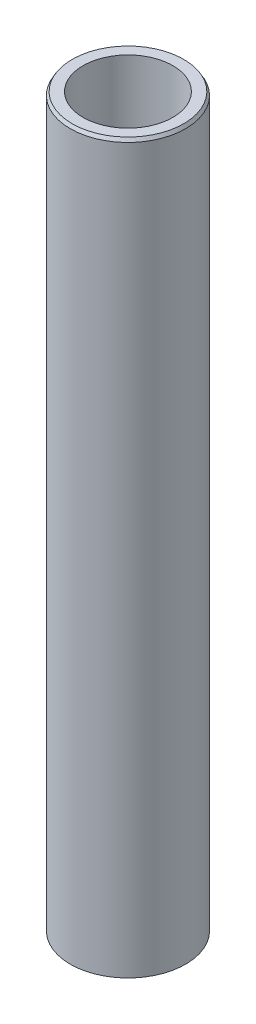
ISO-10303-21;
HEADER;
FILE_DESCRIPTION(('STEP AP214'),'2;1');
FILE_NAME('part.step','',(''),(''),'','','');
FILE_SCHEMA(('AUTOMOTIVE_DESIGN { 1 0 10303 214 1 1 1 1 }'));
ENDSEC;
DATA;
#1=APPLICATION_CONTEXT('core data for automotive mechanical design processes');
#2=APPLICATION_PROTOCOL_DEFINITION('international standard','automotive_design',2000,#1);
#3=PRODUCT_CONTEXT('',#1,'mechanical');
#4=PRODUCT('Part','Part','',(#3));
#5=PRODUCT_RELATED_PRODUCT_CATEGORY('part','',(#4));
#6=PRODUCT_DEFINITION_FORMATION('','',#4);
#7=PRODUCT_DEFINITION_CONTEXT('part definition',#1,'design');
#8=PRODUCT_DEFINITION('design','',#6,#7);
#9=PRODUCT_DEFINITION_SHAPE('','',#8);
#10=(LENGTH_UNIT() NAMED_UNIT(*) SI_UNIT(.MILLI.,.METRE.));
#11=(NAMED_UNIT(*) PLANE_ANGLE_UNIT() SI_UNIT($,.RADIAN.));
#12=(NAMED_UNIT(*) SI_UNIT($,.STERADIAN.) SOLID_ANGLE_UNIT());
#13=UNCERTAINTY_MEASURE_WITH_UNIT(LENGTH_MEASURE(1.E-05),#10,'distance_accuracy_value','');
#14=(GEOMETRIC_REPRESENTATION_CONTEXT(3) GLOBAL_UNCERTAINTY_ASSIGNED_CONTEXT((#13)) GLOBAL_UNIT_ASSIGNED_CONTEXT((#10,
#11,#12)) REPRESENTATION_CONTEXT('',''));
#15=CARTESIAN_POINT('',(0.,0.,0.));
#16=DIRECTION('',(0.,0.,1.));
#17=DIRECTION('',(1.,0.,0.));
#18=AXIS2_PLACEMENT_3D('',#15,#16,#17);
#19=CARTESIAN_POINT('',(0.,600.,0.));
#20=DIRECTION('',(0.,-1.,0.));
#21=DIRECTION('',(0.,0.,-1.));
#22=AXIS2_PLACEMENT_3D('',#19,#20,#21);
#23=CYLINDRICAL_SURFACE('',#22,47.5);
#24=CARTESIAN_POINT('',(0.,597.25450723708,0.));
#25=DIRECTION('',(0.,1.,0.));
#26=DIRECTION('',(0.,0.,1.));
#27=AXIS2_PLACEMENT_3D('',#24,#25,#26);
#28=CIRCLE('',#27,47.5);
#29=CARTESIAN_POINT('',(0.,597.25450723708,47.5));
#30=VERTEX_POINT('',#29);
#31=EDGE_CURVE('E50',#30,#30,#28,.F.);
#32=ORIENTED_EDGE('',*,*,#31,.T.);
#33=EDGE_LOOP('',(#32));
#34=FACE_BOUND('',#33,.T.);
#35=CARTESIAN_POINT('',(0.,1.58511098573011,0.));
#36=DIRECTION('',(0.,1.,0.));
#37=DIRECTION('',(0.,0.,1.));
#38=AXIS2_PLACEMENT_3D('',#35,#36,#37);
#39=CIRCLE('',#38,47.5);
#40=CARTESIAN_POINT('',(0.,1.58511098573011,47.5));
#41=VERTEX_POINT('',#40);
#42=EDGE_CURVE('E51',#41,#41,#39,.T.);
#43=ORIENTED_EDGE('',*,*,#42,.T.);
#44=EDGE_LOOP('',(#43));
#45=FACE_BOUND('',#44,.T.);
#46=ADVANCED_FACE('F39',(#34,#45),#23,.T.);
#47=CARTESIAN_POINT('',(0.,600.,0.));
#48=DIRECTION('',(0.,1.,0.));
#49=DIRECTION('',(0.,0.,1.));
#50=AXIS2_PLACEMENT_3D('',#47,#48,#49);
#51=PLANE('',#50);
#52=CARTESIAN_POINT('',(0.,600.,0.));
#53=DIRECTION('',(0.,1.,0.));
#54=DIRECTION('',(0.,0.,1.));
#55=AXIS2_PLACEMENT_3D('',#52,#53,#54);
#56=CIRCLE('',#55,45.91488901427);
#57=CARTESIAN_POINT('',(0.,600.,45.91488901427));
#58=VERTEX_POINT('',#57);
#59=EDGE_CURVE('E54',#58,#58,#56,.T.);
#60=ORIENTED_EDGE('',*,*,#59,.T.);
#61=EDGE_LOOP('',(#60));
#62=FACE_BOUND('',#61,.T.);
#63=CARTESIAN_POINT('',(0.,600.,0.));
#64=DIRECTION('',(0.,1.,0.));
#65=DIRECTION('',(0.,0.,1.));
#66=AXIS2_PLACEMENT_3D('',#63,#64,#65);
#67=CIRCLE('',#66,36.9484096718129);
#68=CARTESIAN_POINT('',(0.,600.,36.9484096718129));
#69=VERTEX_POINT('',#68);
#70=EDGE_CURVE('E58',#69,#69,#67,.T.);
#71=ORIENTED_EDGE('',*,*,#70,.F.);
#72=EDGE_LOOP('',(#71));
#73=FACE_BOUND('',#72,.T.);
#74=ADVANCED_FACE('F69',(#62,#73),#51,.T.);
#75=CARTESIAN_POINT('',(0.,0.,0.));
#76=DIRECTION('',(0.,1.,0.));
#77=DIRECTION('',(0.,0.,1.));
#78=AXIS2_PLACEMENT_3D('',#75,#76,#77);
#79=PLANE('',#78);
#80=CARTESIAN_POINT('',(0.,0.,0.));
#81=DIRECTION('',(0.,1.,0.));
#82=DIRECTION('',(0.,0.,1.));
#83=AXIS2_PLACEMENT_3D('',#80,#81,#82);
#84=CIRCLE('',#83,44.75450723708);
#85=CARTESIAN_POINT('',(0.,0.,44.75450723708));
#86=VERTEX_POINT('',#85);
#87=EDGE_CURVE('E10',#86,#86,#84,.F.);
#88=ORIENTED_EDGE('',*,*,#87,.T.);
#89=EDGE_LOOP('',(#88));
#90=FACE_BOUND('',#89,.T.);
#91=CARTESIAN_POINT('',(0.,0.,0.));
#92=DIRECTION('',(0.,1.,0.));
#93=DIRECTION('',(0.,0.,1.));
#94=AXIS2_PLACEMENT_3D('',#91,#92,#93);
#95=CIRCLE('',#94,36.9484096718129);
#96=CARTESIAN_POINT('',(0.,0.,36.9484096718129));
#97=VERTEX_POINT('',#96);
#98=EDGE_CURVE('E63',#97,#97,#95,.T.);
#99=ORIENTED_EDGE('',*,*,#98,.T.);
#100=EDGE_LOOP('',(#99));
#101=FACE_BOUND('',#100,.T.);
#102=ADVANCED_FACE('F75',(#90,#101),#79,.F.);
#103=CARTESIAN_POINT('',(0.,600.,0.));
#104=DIRECTION('',(0.,-1.,0.));
#105=DIRECTION('',(0.,0.,-1.));
#106=AXIS2_PLACEMENT_3D('',#103,#104,#105);
#107=CYLINDRICAL_SURFACE('',#106,36.9484096718129);
#108=ORIENTED_EDGE('',*,*,#70,.T.);
#109=EDGE_LOOP('',(#108));
#110=FACE_BOUND('',#109,.T.);
#111=ORIENTED_EDGE('',*,*,#98,.F.);
#112=EDGE_LOOP('',(#111));
#113=FACE_BOUND('',#112,.T.);
#114=ADVANCED_FACE('F70',(#110,#113),#107,.F.);
#115=CARTESIAN_POINT('',(0.,600.,0.));
#116=DIRECTION('',(0.,-1.,0.));
#117=DIRECTION('',(0.,0.,-1.));
#118=AXIS2_PLACEMENT_3D('',#115,#116,#117);
#119=CONICAL_SURFACE('',#118,45.91488901427,0.523598775598277);
#120=ORIENTED_EDGE('',*,*,#31,.F.);
#121=EDGE_LOOP('',(#120));
#122=FACE_BOUND('',#121,.T.);
#123=ORIENTED_EDGE('',*,*,#59,.F.);
#124=EDGE_LOOP('',(#123));
#125=FACE_BOUND('',#124,.T.);
#126=ADVANCED_FACE('F81',(#122,#125),#119,.T.);
#127=CARTESIAN_POINT('',(0.,1.58511098573011,0.));
#128=DIRECTION('',(0.,1.,0.));
#129=DIRECTION('',(0.,0.,1.));
#130=AXIS2_PLACEMENT_3D('',#127,#128,#129);
#131=CONICAL_SURFACE('',#130,47.5,1.04719755119658);
#132=ORIENTED_EDGE('',*,*,#87,.F.);
#133=EDGE_LOOP('',(#132));
#134=FACE_BOUND('',#133,.T.);
#135=ORIENTED_EDGE('',*,*,#42,.F.);
#136=EDGE_LOOP('',(#135));
#137=FACE_BOUND('',#136,.T.);
#138=ADVANCED_FACE('F45',(#134,#137),#131,.T.);
#139=CLOSED_SHELL('',(#46,#74,#102,#114,#126,#138));
#140=MANIFOLD_SOLID_BREP('B2',#139);
#141=ADVANCED_BREP_SHAPE_REPRESENTATION('',(#18,#140),#14);
#142=SHAPE_DEFINITION_REPRESENTATION(#9,#141);
ENDSEC;
END-ISO-10303-21;
